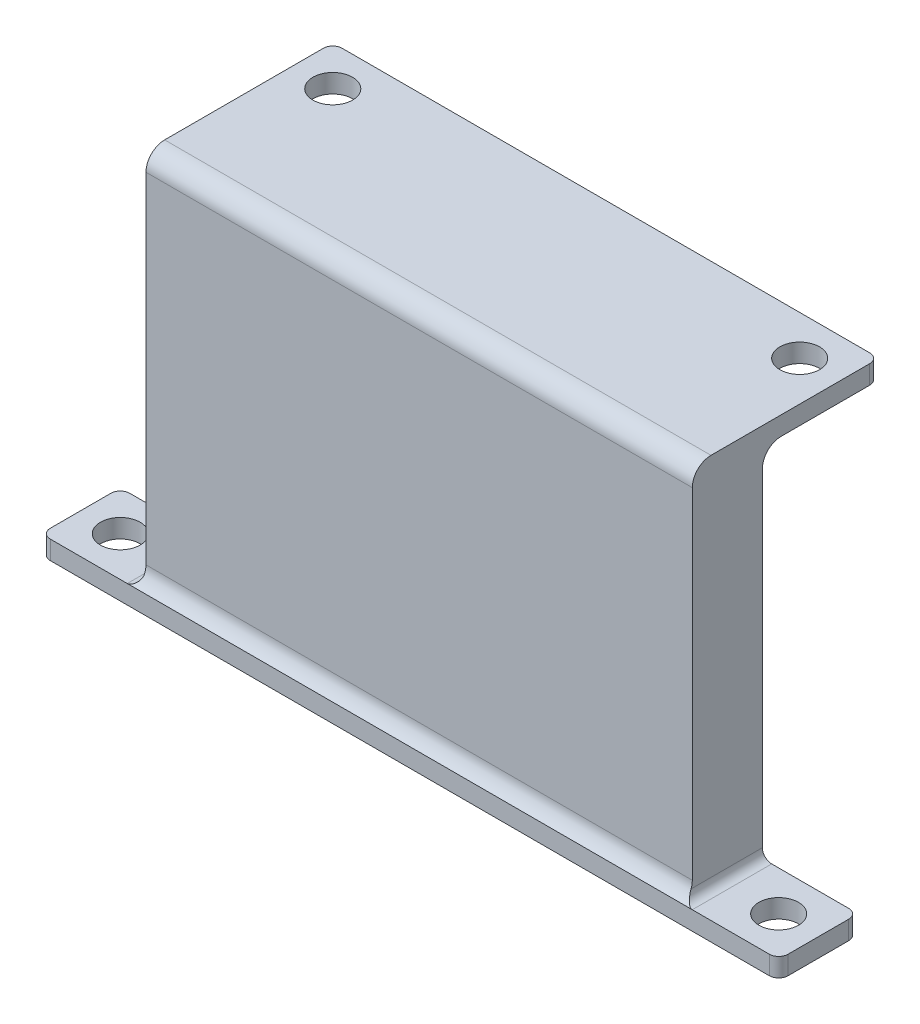
ISO-10303-21;
HEADER;
FILE_DESCRIPTION(('STEP AP214'),'2;1');
FILE_NAME('part.step','',(''),(''),'','','');
FILE_SCHEMA(('AUTOMOTIVE_DESIGN { 1 0 10303 214 1 1 1 1 }'));
ENDSEC;
DATA;
#1=APPLICATION_CONTEXT('core data for automotive mechanical design processes');
#2=APPLICATION_PROTOCOL_DEFINITION('international standard','automotive_design',2000,#1);
#3=PRODUCT_CONTEXT('',#1,'mechanical');
#4=PRODUCT('Part','Part','',(#3));
#5=PRODUCT_RELATED_PRODUCT_CATEGORY('part','',(#4));
#6=PRODUCT_DEFINITION_FORMATION('','',#4);
#7=PRODUCT_DEFINITION_CONTEXT('part definition',#1,'design');
#8=PRODUCT_DEFINITION('design','',#6,#7);
#9=PRODUCT_DEFINITION_SHAPE('','',#8);
#10=(LENGTH_UNIT() NAMED_UNIT(*) SI_UNIT(.MILLI.,.METRE.));
#11=(NAMED_UNIT(*) PLANE_ANGLE_UNIT() SI_UNIT($,.RADIAN.));
#12=(NAMED_UNIT(*) SI_UNIT($,.STERADIAN.) SOLID_ANGLE_UNIT());
#13=UNCERTAINTY_MEASURE_WITH_UNIT(LENGTH_MEASURE(1.E-05),#10,'distance_accuracy_value','');
#14=(GEOMETRIC_REPRESENTATION_CONTEXT(3) GLOBAL_UNCERTAINTY_ASSIGNED_CONTEXT((#13)) GLOBAL_UNIT_ASSIGNED_CONTEXT((#10,
#11,#12)) REPRESENTATION_CONTEXT('',''));
#15=CARTESIAN_POINT('',(0.,0.,0.));
#16=DIRECTION('',(0.,0.,1.));
#17=DIRECTION('',(1.,0.,0.));
#18=AXIS2_PLACEMENT_3D('',#15,#16,#17);
#19=CARTESIAN_POINT('',(0.,2.,0.));
#20=DIRECTION('',(0.,1.,0.));
#21=DIRECTION('',(0.,0.,1.));
#22=AXIS2_PLACEMENT_3D('',#19,#20,#21);
#23=PLANE('',#22);
#24=CARTESIAN_POINT('',(-4.25,2.,-4.24999999999998));
#25=DIRECTION('',(0.,1.,0.));
#26=DIRECTION('',(0.,0.,1.));
#27=AXIS2_PLACEMENT_3D('',#24,#25,#26);
#28=CIRCLE('',#27,2.125);
#29=CARTESIAN_POINT('',(-4.25,2.,-2.12499999999998));
#30=VERTEX_POINT('',#29);
#31=EDGE_CURVE('E348',#30,#30,#28,.T.);
#32=ORIENTED_EDGE('',*,*,#31,.F.);
#33=EDGE_LOOP('',(#32));
#34=FACE_BOUND('',#33,.T.);
#35=DIRECTION('',(-1.,0.,0.));
#36=VECTOR('',#35,1.);
#37=CARTESIAN_POINT('',(0.,2.,-8.5));
#38=LINE('',#37,#36);
#39=CARTESIAN_POINT('',(-1.,2.,-8.5));
#40=VERTEX_POINT('',#39);
#41=CARTESIAN_POINT('',(-9.25000000000001,2.,-8.5));
#42=VERTEX_POINT('',#41);
#43=EDGE_CURVE('E364',#40,#42,#38,.T.);
#44=ORIENTED_EDGE('',*,*,#43,.T.);
#45=DIRECTION('',(0.,0.,-1.));
#46=VECTOR('',#45,1.);
#47=CARTESIAN_POINT('',(-9.25,2.,0.));
#48=LINE('',#47,#46);
#49=CARTESIAN_POINT('',(-9.25,2.,0.));
#50=VERTEX_POINT('',#49);
#51=EDGE_CURVE('E261',#42,#50,#48,.F.);
#52=ORIENTED_EDGE('',*,*,#51,.T.);
#53=DIRECTION('',(1.,0.,0.));
#54=VECTOR('',#53,1.);
#55=CARTESIAN_POINT('',(0.,2.,0.));
#56=LINE('',#55,#54);
#57=CARTESIAN_POINT('',(-1.,2.,0.));
#58=VERTEX_POINT('',#57);
#59=EDGE_CURVE('E210',#50,#58,#56,.T.);
#60=ORIENTED_EDGE('',*,*,#59,.T.);
#61=CARTESIAN_POINT('',(-1.,2.,-1.));
#62=DIRECTION('',(0.,1.,0.));
#63=DIRECTION('',(0.,0.,1.));
#64=AXIS2_PLACEMENT_3D('',#61,#62,#63);
#65=CIRCLE('',#64,1.);
#66=CARTESIAN_POINT('',(0.,2.,-1.));
#67=VERTEX_POINT('',#66);
#68=EDGE_CURVE('E245',#58,#67,#65,.T.);
#69=ORIENTED_EDGE('',*,*,#68,.T.);
#70=DIRECTION('',(0.,0.,-1.));
#71=VECTOR('',#70,1.);
#72=CARTESIAN_POINT('',(0.,2.,0.));
#73=LINE('',#72,#71);
#74=CARTESIAN_POINT('',(0.,2.,-7.5));
#75=VERTEX_POINT('',#74);
#76=EDGE_CURVE('E353',#67,#75,#73,.T.);
#77=ORIENTED_EDGE('',*,*,#76,.T.);
#78=CARTESIAN_POINT('',(-1.,2.,-7.5));
#79=DIRECTION('',(0.,1.,0.));
#80=DIRECTION('',(0.,0.,1.));
#81=AXIS2_PLACEMENT_3D('',#78,#79,#80);
#82=CIRCLE('',#81,1.);
#83=EDGE_CURVE('E247',#75,#40,#82,.T.);
#84=ORIENTED_EDGE('',*,*,#83,.T.);
#85=EDGE_LOOP('',(#44,#52,#60,#69,#77,#84));
#86=FACE_BOUND('',#85,.T.);
#87=ADVANCED_FACE('F35',(#34,#86),#23,.T.);
#88=CARTESIAN_POINT('',(0.,2.,-8.5));
#89=DIRECTION('',(0.,0.,1.));
#90=DIRECTION('',(1.,0.,0.));
#91=AXIS2_PLACEMENT_3D('',#88,#89,#90);
#92=PLANE('',#91);
#93=DIRECTION('',(-1.,0.,0.));
#94=VECTOR('',#93,1.);
#95=CARTESIAN_POINT('',(0.,0.,-8.5));
#96=LINE('',#95,#94);
#97=CARTESIAN_POINT('',(-1.,0.,-8.5));
#98=VERTEX_POINT('',#97);
#99=CARTESIAN_POINT('',(-78.,0.,-8.49999999999998));
#100=VERTEX_POINT('',#99);
#101=EDGE_CURVE('E345',#98,#100,#96,.T.);
#102=ORIENTED_EDGE('',*,*,#101,.T.);
#103=DIRECTION('',(0.,-1.,0.));
#104=VECTOR('',#103,1.);
#105=CARTESIAN_POINT('',(-78.,2.,-8.49999999999998));
#106=LINE('',#105,#104);
#107=CARTESIAN_POINT('',(-78.,2.,-8.49999999999998));
#108=VERTEX_POINT('',#107);
#109=EDGE_CURVE('E373',#100,#108,#106,.F.);
#110=ORIENTED_EDGE('',*,*,#109,.T.);
#111=CARTESIAN_POINT('',(-69.75,2.,-8.49999999999998));
#112=VERTEX_POINT('',#111);
#113=EDGE_CURVE('E356',#112,#108,#38,.T.);
#114=ORIENTED_EDGE('',*,*,#113,.F.);
#115=CARTESIAN_POINT('',(-69.75,3.,-8.49999999999998));
#116=DIRECTION('',(0.,0.,1.));
#117=DIRECTION('',(1.,0.,0.));
#118=AXIS2_PLACEMENT_3D('',#115,#116,#117);
#119=CIRCLE('',#118,1.);
#120=CARTESIAN_POINT('',(-68.75,3.,-8.49999999999999));
#121=VERTEX_POINT('',#120);
#122=EDGE_CURVE('E11',#112,#121,#119,.T.);
#123=ORIENTED_EDGE('',*,*,#122,.T.);
#124=DIRECTION('',(0.,-1.,0.));
#125=VECTOR('',#124,1.);
#126=CARTESIAN_POINT('',(-68.75,42.14,-8.49999999999999));
#127=LINE('',#126,#125);
#128=CARTESIAN_POINT('',(-68.75,38.14,-8.49999999999999));
#129=VERTEX_POINT('',#128);
#130=EDGE_CURVE('E220',#129,#121,#127,.T.);
#131=ORIENTED_EDGE('',*,*,#130,.F.);
#132=DIRECTION('',(-1.,0.,0.));
#133=VECTOR('',#132,1.);
#134=CARTESIAN_POINT('',(-10.25,38.14,-8.5));
#135=LINE('',#134,#133);
#136=CARTESIAN_POINT('',(-10.25,38.14,-8.49999999999999));
#137=VERTEX_POINT('',#136);
#138=EDGE_CURVE('E199',#129,#137,#135,.F.);
#139=ORIENTED_EDGE('',*,*,#138,.T.);
#140=DIRECTION('',(0.,-1.,0.));
#141=VECTOR('',#140,1.);
#142=CARTESIAN_POINT('',(-10.25,42.14,-8.49999999999999));
#143=LINE('',#142,#141);
#144=CARTESIAN_POINT('',(-10.25,3.,-8.49999999999999));
#145=VERTEX_POINT('',#144);
#146=EDGE_CURVE('E215',#137,#145,#143,.T.);
#147=ORIENTED_EDGE('',*,*,#146,.T.);
#148=CARTESIAN_POINT('',(-9.25000000000001,3.,-8.5));
#149=DIRECTION('',(0.,0.,1.));
#150=DIRECTION('',(1.,0.,0.));
#151=AXIS2_PLACEMENT_3D('',#148,#149,#150);
#152=CIRCLE('',#151,1.);
#153=EDGE_CURVE('E264',#145,#42,#152,.T.);
#154=ORIENTED_EDGE('',*,*,#153,.T.);
#155=ORIENTED_EDGE('',*,*,#43,.F.);
#156=DIRECTION('',(0.,-1.,0.));
#157=VECTOR('',#156,1.);
#158=CARTESIAN_POINT('',(-1.,2.,-8.5));
#159=LINE('',#158,#157);
#160=EDGE_CURVE('E370',#40,#98,#159,.T.);
#161=ORIENTED_EDGE('',*,*,#160,.T.);
#162=EDGE_LOOP('',(#102,#110,#114,#123,#131,#139,#147,#154,#155,#161));
#163=FACE_BOUND('',#162,.T.);
#164=ADVANCED_FACE('F315',(#163),#92,.F.);
#165=CARTESIAN_POINT('',(-78.,2.,0.));
#166=VERTEX_POINT('',#165);
#167=CARTESIAN_POINT('',(-69.75,2.,0.));
#168=VERTEX_POINT('',#167);
#169=EDGE_CURVE('E206',#166,#168,#56,.T.);
#170=ORIENTED_EDGE('',*,*,#169,.T.);
#171=DIRECTION('',(0.,0.,1.));
#172=VECTOR('',#171,1.);
#173=CARTESIAN_POINT('',(-69.75,2.,0.));
#174=LINE('',#173,#172);
#175=EDGE_CURVE('E58',#168,#112,#174,.F.);
#176=ORIENTED_EDGE('',*,*,#175,.T.);
#177=ORIENTED_EDGE('',*,*,#113,.T.);
#178=CARTESIAN_POINT('',(-78.,2.,-7.49999999999998));
#179=DIRECTION('',(0.,1.,0.));
#180=DIRECTION('',(0.,0.,1.));
#181=AXIS2_PLACEMENT_3D('',#178,#179,#180);
#182=CIRCLE('',#181,1.);
#183=CARTESIAN_POINT('',(-79.,2.,-7.49999999999998));
#184=VERTEX_POINT('',#183);
#185=EDGE_CURVE('E509',#108,#184,#182,.T.);
#186=ORIENTED_EDGE('',*,*,#185,.T.);
#187=DIRECTION('',(0.,0.,1.));
#188=VECTOR('',#187,1.);
#189=CARTESIAN_POINT('',(-79.,2.,0.));
#190=LINE('',#189,#188);
#191=CARTESIAN_POINT('',(-79.,2.,-0.999999999999985));
#192=VERTEX_POINT('',#191);
#193=EDGE_CURVE('E360',#184,#192,#190,.T.);
#194=ORIENTED_EDGE('',*,*,#193,.T.);
#195=CARTESIAN_POINT('',(-78.,2.,-0.999999999999985));
#196=DIRECTION('',(0.,1.,0.));
#197=DIRECTION('',(0.,0.,1.));
#198=AXIS2_PLACEMENT_3D('',#195,#196,#197);
#199=CIRCLE('',#198,1.);
#200=EDGE_CURVE('E368',#192,#166,#199,.T.);
#201=ORIENTED_EDGE('',*,*,#200,.T.);
#202=EDGE_LOOP('',(#170,#176,#177,#186,#194,#201));
#203=FACE_BOUND('',#202,.T.);
#204=CARTESIAN_POINT('',(-74.75,2.,-4.24999999999998));
#205=DIRECTION('',(0.,1.,0.));
#206=DIRECTION('',(0.,0.,1.));
#207=AXIS2_PLACEMENT_3D('',#204,#205,#206);
#208=CIRCLE('',#207,2.125);
#209=CARTESIAN_POINT('',(-74.75,2.,-2.12499999999998));
#210=VERTEX_POINT('',#209);
#211=EDGE_CURVE('E339',#210,#210,#208,.T.);
#212=ORIENTED_EDGE('',*,*,#211,.F.);
#213=EDGE_LOOP('',(#212));
#214=FACE_BOUND('',#213,.T.);
#215=ADVANCED_FACE('F318',(#203,#214),#23,.T.);
#216=CARTESIAN_POINT('',(0.,0.,0.));
#217=DIRECTION('',(0.,1.,0.));
#218=DIRECTION('',(0.,0.,1.));
#219=AXIS2_PLACEMENT_3D('',#216,#217,#218);
#220=PLANE('',#219);
#221=DIRECTION('',(1.,0.,0.));
#222=VECTOR('',#221,1.);
#223=CARTESIAN_POINT('',(0.,0.,0.));
#224=LINE('',#223,#222);
#225=CARTESIAN_POINT('',(-78.,0.,0.));
#226=VERTEX_POINT('',#225);
#227=CARTESIAN_POINT('',(-1.,0.,0.));
#228=VERTEX_POINT('',#227);
#229=EDGE_CURVE('E357',#226,#228,#224,.T.);
#230=ORIENTED_EDGE('',*,*,#229,.F.);
#231=CARTESIAN_POINT('',(-78.,0.,-0.999999999999985));
#232=DIRECTION('',(0.,1.,0.));
#233=DIRECTION('',(0.,0.,1.));
#234=AXIS2_PLACEMENT_3D('',#231,#232,#233);
#235=CIRCLE('',#234,1.);
#236=CARTESIAN_POINT('',(-79.,0.,-0.999999999999985));
#237=VERTEX_POINT('',#236);
#238=EDGE_CURVE('E490',#226,#237,#235,.F.);
#239=ORIENTED_EDGE('',*,*,#238,.T.);
#240=DIRECTION('',(0.,0.,1.));
#241=VECTOR('',#240,1.);
#242=CARTESIAN_POINT('',(-79.,0.,0.));
#243=LINE('',#242,#241);
#244=CARTESIAN_POINT('',(-79.,0.,-7.49999999999998));
#245=VERTEX_POINT('',#244);
#246=EDGE_CURVE('E517',#245,#237,#243,.T.);
#247=ORIENTED_EDGE('',*,*,#246,.F.);
#248=CARTESIAN_POINT('',(-78.,0.,-7.49999999999998));
#249=DIRECTION('',(0.,1.,0.));
#250=DIRECTION('',(0.,0.,1.));
#251=AXIS2_PLACEMENT_3D('',#248,#249,#250);
#252=CIRCLE('',#251,1.);
#253=EDGE_CURVE('E502',#245,#100,#252,.F.);
#254=ORIENTED_EDGE('',*,*,#253,.T.);
#255=ORIENTED_EDGE('',*,*,#101,.F.);
#256=CARTESIAN_POINT('',(-1.,0.,-7.5));
#257=DIRECTION('',(0.,1.,0.));
#258=DIRECTION('',(0.,0.,1.));
#259=AXIS2_PLACEMENT_3D('',#256,#257,#258);
#260=CIRCLE('',#259,1.);
#261=CARTESIAN_POINT('',(0.,0.,-7.5));
#262=VERTEX_POINT('',#261);
#263=EDGE_CURVE('E494',#98,#262,#260,.F.);
#264=ORIENTED_EDGE('',*,*,#263,.T.);
#265=DIRECTION('',(0.,0.,-1.));
#266=VECTOR('',#265,1.);
#267=CARTESIAN_POINT('',(0.,0.,0.));
#268=LINE('',#267,#266);
#269=CARTESIAN_POINT('',(0.,0.,-1.));
#270=VERTEX_POINT('',#269);
#271=EDGE_CURVE('E341',#270,#262,#268,.T.);
#272=ORIENTED_EDGE('',*,*,#271,.F.);
#273=CARTESIAN_POINT('',(-1.,0.,-1.));
#274=DIRECTION('',(0.,1.,0.));
#275=DIRECTION('',(0.,0.,1.));
#276=AXIS2_PLACEMENT_3D('',#273,#274,#275);
#277=CIRCLE('',#276,1.);
#278=EDGE_CURVE('E491',#270,#228,#277,.F.);
#279=ORIENTED_EDGE('',*,*,#278,.T.);
#280=EDGE_LOOP('',(#230,#239,#247,#254,#255,#264,#272,#279));
#281=FACE_BOUND('',#280,.T.);
#282=CARTESIAN_POINT('',(-74.75,0.,-4.24999999999998));
#283=DIRECTION('',(0.,1.,0.));
#284=DIRECTION('',(0.,0.,1.));
#285=AXIS2_PLACEMENT_3D('',#282,#283,#284);
#286=CIRCLE('',#285,2.125);
#287=CARTESIAN_POINT('',(-74.75,0.,-2.12499999999998));
#288=VERTEX_POINT('',#287);
#289=EDGE_CURVE('E342',#288,#288,#286,.T.);
#290=ORIENTED_EDGE('',*,*,#289,.T.);
#291=EDGE_LOOP('',(#290));
#292=FACE_BOUND('',#291,.T.);
#293=CARTESIAN_POINT('',(-4.25,0.,-4.24999999999998));
#294=DIRECTION('',(0.,1.,0.));
#295=DIRECTION('',(0.,0.,1.));
#296=AXIS2_PLACEMENT_3D('',#293,#294,#295);
#297=CIRCLE('',#296,2.125);
#298=CARTESIAN_POINT('',(-4.25,0.,-2.12499999999998));
#299=VERTEX_POINT('',#298);
#300=EDGE_CURVE('E219',#299,#299,#297,.T.);
#301=ORIENTED_EDGE('',*,*,#300,.T.);
#302=EDGE_LOOP('',(#301));
#303=FACE_BOUND('',#302,.T.);
#304=ADVANCED_FACE('F329',(#281,#292,#303),#220,.F.);
#305=CARTESIAN_POINT('',(0.,2.,0.));
#306=DIRECTION('',(-1.,0.,0.));
#307=DIRECTION('',(0.,0.,1.));
#308=AXIS2_PLACEMENT_3D('',#305,#306,#307);
#309=PLANE('',#308);
#310=ORIENTED_EDGE('',*,*,#271,.T.);
#311=DIRECTION('',(0.,-1.,0.));
#312=VECTOR('',#311,1.);
#313=CARTESIAN_POINT('',(0.,2.,-7.5));
#314=LINE('',#313,#312);
#315=EDGE_CURVE('E243',#262,#75,#314,.F.);
#316=ORIENTED_EDGE('',*,*,#315,.T.);
#317=ORIENTED_EDGE('',*,*,#76,.F.);
#318=DIRECTION('',(0.,-1.,0.));
#319=VECTOR('',#318,1.);
#320=CARTESIAN_POINT('',(0.,2.,-1.));
#321=LINE('',#320,#319);
#322=EDGE_CURVE('E240',#67,#270,#321,.T.);
#323=ORIENTED_EDGE('',*,*,#322,.T.);
#324=EDGE_LOOP('',(#310,#316,#317,#323));
#325=FACE_BOUND('',#324,.T.);
#326=ADVANCED_FACE('F333',(#325),#309,.F.);
#327=CARTESIAN_POINT('',(-79.,2.,0.));
#328=DIRECTION('',(1.,0.,0.));
#329=DIRECTION('',(0.,0.,-1.));
#330=AXIS2_PLACEMENT_3D('',#327,#328,#329);
#331=PLANE('',#330);
#332=ORIENTED_EDGE('',*,*,#246,.T.);
#333=DIRECTION('',(0.,-1.,0.));
#334=VECTOR('',#333,1.);
#335=CARTESIAN_POINT('',(-79.,2.,-0.999999999999985));
#336=LINE('',#335,#334);
#337=EDGE_CURVE('E508',#237,#192,#336,.F.);
#338=ORIENTED_EDGE('',*,*,#337,.T.);
#339=ORIENTED_EDGE('',*,*,#193,.F.);
#340=DIRECTION('',(0.,-1.,0.));
#341=VECTOR('',#340,1.);
#342=CARTESIAN_POINT('',(-79.,2.,-7.49999999999998));
#343=LINE('',#342,#341);
#344=EDGE_CURVE('E505',#184,#245,#343,.T.);
#345=ORIENTED_EDGE('',*,*,#344,.T.);
#346=EDGE_LOOP('',(#332,#338,#339,#345));
#347=FACE_BOUND('',#346,.T.);
#348=ADVANCED_FACE('F475',(#347),#331,.F.);
#349=CARTESIAN_POINT('',(0.,2.,0.));
#350=DIRECTION('',(0.,0.,-1.));
#351=DIRECTION('',(-1.,0.,0.));
#352=AXIS2_PLACEMENT_3D('',#349,#350,#351);
#353=PLANE('',#352);
#354=ORIENTED_EDGE('',*,*,#169,.F.);
#355=DIRECTION('',(0.,-1.,0.));
#356=VECTOR('',#355,1.);
#357=CARTESIAN_POINT('',(-78.,2.,0.));
#358=LINE('',#357,#356);
#359=EDGE_CURVE('E487',#166,#226,#358,.T.);
#360=ORIENTED_EDGE('',*,*,#359,.T.);
#361=ORIENTED_EDGE('',*,*,#229,.T.);
#362=DIRECTION('',(0.,-1.,0.));
#363=VECTOR('',#362,1.);
#364=CARTESIAN_POINT('',(-1.,2.,0.));
#365=LINE('',#364,#363);
#366=EDGE_CURVE('E492',#228,#58,#365,.F.);
#367=ORIENTED_EDGE('',*,*,#366,.T.);
#368=ORIENTED_EDGE('',*,*,#59,.F.);
#369=EDGE_CURVE('E51',#168,#50,#56,.T.);
#370=ORIENTED_EDGE('',*,*,#369,.F.);
#371=EDGE_LOOP('',(#354,#360,#361,#367,#368,#370));
#372=FACE_BOUND('',#371,.T.);
#373=ADVANCED_FACE('F430',(#372),#353,.F.);
#374=CARTESIAN_POINT('',(-74.75,2.,-4.24999999999998));
#375=DIRECTION('',(0.,-1.,0.));
#376=DIRECTION('',(0.,0.,-1.));
#377=AXIS2_PLACEMENT_3D('',#374,#375,#376);
#378=CYLINDRICAL_SURFACE('',#377,2.125);
#379=ORIENTED_EDGE('',*,*,#211,.T.);
#380=EDGE_LOOP('',(#379));
#381=FACE_BOUND('',#380,.T.);
#382=ORIENTED_EDGE('',*,*,#289,.F.);
#383=EDGE_LOOP('',(#382));
#384=FACE_BOUND('',#383,.T.);
#385=ADVANCED_FACE('F422',(#381,#384),#378,.F.);
#386=CARTESIAN_POINT('',(-4.25,2.,-4.24999999999998));
#387=DIRECTION('',(0.,-1.,0.));
#388=DIRECTION('',(0.,0.,-1.));
#389=AXIS2_PLACEMENT_3D('',#386,#387,#388);
#390=CYLINDRICAL_SURFACE('',#389,2.125);
#391=ORIENTED_EDGE('',*,*,#31,.T.);
#392=EDGE_LOOP('',(#391));
#393=FACE_BOUND('',#392,.T.);
#394=ORIENTED_EDGE('',*,*,#300,.F.);
#395=EDGE_LOOP('',(#394));
#396=FACE_BOUND('',#395,.T.);
#397=ADVANCED_FACE('F419',(#393,#396),#390,.F.);
#398=CARTESIAN_POINT('',(-10.25,42.14,-0.999999999999996));
#399=DIRECTION('',(-1.,0.,0.));
#400=DIRECTION('',(0.,0.,1.));
#401=AXIS2_PLACEMENT_3D('',#398,#399,#400);
#402=PLANE('',#401);
#403=CARTESIAN_POINT('',(-10.25,3.73205080756887,1.00000000000001));
#404=DIRECTION('',(-1.,0.,0.));
#405=DIRECTION('',(0.,0.,1.));
#406=AXIS2_PLACEMENT_3D('',#403,#404,#405);
#407=CIRCLE('',#406,2.);
#408=CARTESIAN_POINT('',(-10.25,3.73205080756887,-0.999999999999996));
#409=VERTEX_POINT('',#408);
#410=CARTESIAN_POINT('',(-10.25,3.,-0.861209718204195));
#411=VERTEX_POINT('',#410);
#412=EDGE_CURVE('E535',#409,#411,#407,.T.);
#413=ORIENTED_EDGE('',*,*,#412,.T.);
#414=DIRECTION('',(0.,0.,-1.));
#415=VECTOR('',#414,1.);
#416=CARTESIAN_POINT('',(-10.25,3.,-0.999999999999996));
#417=LINE('',#416,#415);
#418=EDGE_CURVE('E258',#411,#145,#417,.T.);
#419=ORIENTED_EDGE('',*,*,#418,.T.);
#420=ORIENTED_EDGE('',*,*,#146,.F.);
#421=CARTESIAN_POINT('',(-10.25,38.14,-10.5));
#422=DIRECTION('',(-1.,0.,0.));
#423=DIRECTION('',(0.,0.,1.));
#424=AXIS2_PLACEMENT_3D('',#421,#422,#423);
#425=CIRCLE('',#424,2.);
#426=CARTESIAN_POINT('',(-10.25,40.14,-10.5));
#427=VERTEX_POINT('',#426);
#428=EDGE_CURVE('E200',#137,#427,#425,.T.);
#429=ORIENTED_EDGE('',*,*,#428,.T.);
#430=DIRECTION('',(0.,0.,1.));
#431=VECTOR('',#430,1.);
#432=CARTESIAN_POINT('',(-10.25,40.14,-21.));
#433=LINE('',#432,#431);
#434=CARTESIAN_POINT('',(-10.25,40.14,-20.));
#435=VERTEX_POINT('',#434);
#436=EDGE_CURVE('E190',#435,#427,#433,.T.);
#437=ORIENTED_EDGE('',*,*,#436,.F.);
#438=DIRECTION('',(0.,-1.,0.));
#439=VECTOR('',#438,1.);
#440=CARTESIAN_POINT('',(-10.25,42.14,-20.));
#441=LINE('',#440,#439);
#442=CARTESIAN_POINT('',(-10.25,42.14,-20.));
#443=VERTEX_POINT('',#442);
#444=EDGE_CURVE('E237',#435,#443,#441,.F.);
#445=ORIENTED_EDGE('',*,*,#444,.T.);
#446=DIRECTION('',(0.,0.,-1.));
#447=VECTOR('',#446,1.);
#448=CARTESIAN_POINT('',(-10.25,42.14,-0.999999999999996));
#449=LINE('',#448,#447);
#450=CARTESIAN_POINT('',(-10.25,42.14,-3.));
#451=VERTEX_POINT('',#450);
#452=EDGE_CURVE('E233',#451,#443,#449,.T.);
#453=ORIENTED_EDGE('',*,*,#452,.F.);
#454=CARTESIAN_POINT('',(-10.25,40.14,-3.));
#455=DIRECTION('',(-1.,0.,0.));
#456=DIRECTION('',(0.,0.,1.));
#457=AXIS2_PLACEMENT_3D('',#454,#455,#456);
#458=CIRCLE('',#457,2.);
#459=CARTESIAN_POINT('',(-10.25,40.14,-0.999999999999996));
#460=VERTEX_POINT('',#459);
#461=EDGE_CURVE('E252',#451,#460,#458,.F.);
#462=ORIENTED_EDGE('',*,*,#461,.T.);
#463=DIRECTION('',(0.,-1.,0.));
#464=VECTOR('',#463,1.);
#465=CARTESIAN_POINT('',(-10.25,42.14,-0.999999999999996));
#466=LINE('',#465,#464);
#467=EDGE_CURVE('E393',#460,#409,#466,.T.);
#468=ORIENTED_EDGE('',*,*,#467,.T.);
#469=EDGE_LOOP('',(#413,#419,#420,#429,#437,#445,#453,#462,#468));
#470=FACE_BOUND('',#469,.T.);
#471=ADVANCED_FACE('F421',(#470),#402,.F.);
#472=CARTESIAN_POINT('',(-68.75,42.14,-0.999999999999996));
#473=DIRECTION('',(1.,0.,0.));
#474=DIRECTION('',(0.,0.,-1.));
#475=AXIS2_PLACEMENT_3D('',#472,#473,#474);
#476=PLANE('',#475);
#477=ORIENTED_EDGE('',*,*,#130,.T.);
#478=DIRECTION('',(0.,0.,1.));
#479=VECTOR('',#478,1.);
#480=CARTESIAN_POINT('',(-68.75,3.,-0.999999999999996));
#481=LINE('',#480,#479);
#482=CARTESIAN_POINT('',(-68.75,3.,-0.861209718204183));
#483=VERTEX_POINT('',#482);
#484=EDGE_CURVE('E272',#121,#483,#481,.T.);
#485=ORIENTED_EDGE('',*,*,#484,.T.);
#486=CARTESIAN_POINT('',(-68.75,3.73205080756887,1.00000000000002));
#487=DIRECTION('',(1.,0.,0.));
#488=DIRECTION('',(0.,0.,-1.));
#489=AXIS2_PLACEMENT_3D('',#486,#487,#488);
#490=CIRCLE('',#489,2.);
#491=CARTESIAN_POINT('',(-68.75,3.73205080756887,-0.999999999999996));
#492=VERTEX_POINT('',#491);
#493=EDGE_CURVE('E497',#483,#492,#490,.T.);
#494=ORIENTED_EDGE('',*,*,#493,.T.);
#495=DIRECTION('',(0.,-1.,0.));
#496=VECTOR('',#495,1.);
#497=CARTESIAN_POINT('',(-68.75,42.14,-0.999999999999996));
#498=LINE('',#497,#496);
#499=CARTESIAN_POINT('',(-68.75,40.14,-0.999999999999996));
#500=VERTEX_POINT('',#499);
#501=EDGE_CURVE('E411',#500,#492,#498,.T.);
#502=ORIENTED_EDGE('',*,*,#501,.F.);
#503=CARTESIAN_POINT('',(-68.75,40.14,-3.));
#504=DIRECTION('',(1.,0.,0.));
#505=DIRECTION('',(0.,0.,-1.));
#506=AXIS2_PLACEMENT_3D('',#503,#504,#505);
#507=CIRCLE('',#506,2.);
#508=CARTESIAN_POINT('',(-68.75,42.14,-3.));
#509=VERTEX_POINT('',#508);
#510=EDGE_CURVE('E256',#500,#509,#507,.F.);
#511=ORIENTED_EDGE('',*,*,#510,.T.);
#512=DIRECTION('',(0.,0.,1.));
#513=VECTOR('',#512,1.);
#514=CARTESIAN_POINT('',(-68.75,42.14,-0.999999999999996));
#515=LINE('',#514,#513);
#516=CARTESIAN_POINT('',(-68.75,42.14,-20.));
#517=VERTEX_POINT('',#516);
#518=EDGE_CURVE('E388',#517,#509,#515,.T.);
#519=ORIENTED_EDGE('',*,*,#518,.F.);
#520=DIRECTION('',(0.,1.,0.));
#521=VECTOR('',#520,1.);
#522=CARTESIAN_POINT('',(-68.75,40.14,-20.));
#523=LINE('',#522,#521);
#524=CARTESIAN_POINT('',(-68.75,40.14,-20.));
#525=VERTEX_POINT('',#524);
#526=EDGE_CURVE('E186',#517,#525,#523,.F.);
#527=ORIENTED_EDGE('',*,*,#526,.T.);
#528=DIRECTION('',(0.,0.,1.));
#529=VECTOR('',#528,1.);
#530=CARTESIAN_POINT('',(-68.75,40.14,-21.));
#531=LINE('',#530,#529);
#532=CARTESIAN_POINT('',(-68.75,40.14,-10.5));
#533=VERTEX_POINT('',#532);
#534=EDGE_CURVE('E178',#525,#533,#531,.T.);
#535=ORIENTED_EDGE('',*,*,#534,.T.);
#536=CARTESIAN_POINT('',(-68.75,38.14,-10.5));
#537=DIRECTION('',(1.,0.,0.));
#538=DIRECTION('',(0.,0.,-1.));
#539=AXIS2_PLACEMENT_3D('',#536,#537,#538);
#540=CIRCLE('',#539,2.);
#541=EDGE_CURVE('E182',#533,#129,#540,.T.);
#542=ORIENTED_EDGE('',*,*,#541,.T.);
#543=EDGE_LOOP('',(#477,#485,#494,#502,#511,#519,#527,#535,#542));
#544=FACE_BOUND('',#543,.T.);
#545=ADVANCED_FACE('F181',(#544),#476,.F.);
#546=CARTESIAN_POINT('',(-68.75,42.14,-0.999999999999996));
#547=DIRECTION('',(0.,0.,-1.));
#548=DIRECTION('',(-1.,0.,0.));
#549=AXIS2_PLACEMENT_3D('',#546,#547,#548);
#550=PLANE('',#549);
#551=ORIENTED_EDGE('',*,*,#467,.F.);
#552=DIRECTION('',(1.,0.,0.));
#553=VECTOR('',#552,1.);
#554=CARTESIAN_POINT('',(-68.75,40.14,-0.999999999999996));
#555=LINE('',#554,#553);
#556=EDGE_CURVE('E254',#460,#500,#555,.F.);
#557=ORIENTED_EDGE('',*,*,#556,.T.);
#558=ORIENTED_EDGE('',*,*,#501,.T.);
#559=DIRECTION('',(-1.,0.,0.));
#560=VECTOR('',#559,1.);
#561=CARTESIAN_POINT('',(-68.75,3.73205080756887,-0.999999999999996));
#562=LINE('',#561,#560);
#563=EDGE_CURVE('E201',#492,#409,#562,.F.);
#564=ORIENTED_EDGE('',*,*,#563,.T.);
#565=EDGE_LOOP('',(#551,#557,#558,#564));
#566=FACE_BOUND('',#565,.T.);
#567=ADVANCED_FACE('F434',(#566),#550,.F.);
#568=CARTESIAN_POINT('',(0.,42.14,0.));
#569=DIRECTION('',(0.,-1.,0.));
#570=DIRECTION('',(0.,0.,-1.));
#571=AXIS2_PLACEMENT_3D('',#568,#569,#570);
#572=PLANE('',#571);
#573=CARTESIAN_POINT('',(-64.5,42.14,-16.75));
#574=DIRECTION('',(0.,1.,0.));
#575=DIRECTION('',(0.,0.,1.));
#576=AXIS2_PLACEMENT_3D('',#573,#574,#575);
#577=CIRCLE('',#576,2.125);
#578=CARTESIAN_POINT('',(-64.5,42.14,-14.625));
#579=VERTEX_POINT('',#578);
#580=EDGE_CURVE('E459',#579,#579,#577,.T.);
#581=ORIENTED_EDGE('',*,*,#580,.F.);
#582=EDGE_LOOP('',(#581));
#583=FACE_BOUND('',#582,.T.);
#584=CARTESIAN_POINT('',(-14.5,42.14,-16.75));
#585=DIRECTION('',(0.,1.,0.));
#586=DIRECTION('',(0.,0.,1.));
#587=AXIS2_PLACEMENT_3D('',#584,#585,#586);
#588=CIRCLE('',#587,2.125);
#589=CARTESIAN_POINT('',(-14.5,42.14,-14.625));
#590=VERTEX_POINT('',#589);
#591=EDGE_CURVE('E405',#590,#590,#588,.T.);
#592=ORIENTED_EDGE('',*,*,#591,.F.);
#593=EDGE_LOOP('',(#592));
#594=FACE_BOUND('',#593,.T.);
#595=ORIENTED_EDGE('',*,*,#518,.T.);
#596=DIRECTION('',(1.,0.,0.));
#597=VECTOR('',#596,1.);
#598=CARTESIAN_POINT('',(0.,42.14,-3.));
#599=LINE('',#598,#597);
#600=EDGE_CURVE('E249',#509,#451,#599,.T.);
#601=ORIENTED_EDGE('',*,*,#600,.T.);
#602=ORIENTED_EDGE('',*,*,#452,.T.);
#603=CARTESIAN_POINT('',(-11.25,42.14,-20.));
#604=DIRECTION('',(0.,-1.,0.));
#605=DIRECTION('',(0.,0.,-1.));
#606=AXIS2_PLACEMENT_3D('',#603,#604,#605);
#607=CIRCLE('',#606,1.);
#608=CARTESIAN_POINT('',(-11.25,42.14,-21.));
#609=VERTEX_POINT('',#608);
#610=EDGE_CURVE('E381',#443,#609,#607,.F.);
#611=ORIENTED_EDGE('',*,*,#610,.T.);
#612=DIRECTION('',(1.,0.,0.));
#613=VECTOR('',#612,1.);
#614=CARTESIAN_POINT('',(-10.25,42.14,-21.));
#615=LINE('',#614,#613);
#616=CARTESIAN_POINT('',(-67.75,42.14,-21.));
#617=VERTEX_POINT('',#616);
#618=EDGE_CURVE('E191',#617,#609,#615,.T.);
#619=ORIENTED_EDGE('',*,*,#618,.F.);
#620=CARTESIAN_POINT('',(-67.75,42.14,-20.));
#621=DIRECTION('',(0.,-1.,0.));
#622=DIRECTION('',(0.,0.,-1.));
#623=AXIS2_PLACEMENT_3D('',#620,#621,#622);
#624=CIRCLE('',#623,1.);
#625=EDGE_CURVE('E228',#617,#517,#624,.F.);
#626=ORIENTED_EDGE('',*,*,#625,.T.);
#627=EDGE_LOOP('',(#595,#601,#602,#611,#619,#626));
#628=FACE_BOUND('',#627,.T.);
#629=ADVANCED_FACE('F387',(#583,#594,#628),#572,.F.);
#630=CARTESIAN_POINT('',(-10.25,40.14,-21.));
#631=DIRECTION('',(0.,1.,0.));
#632=DIRECTION('',(0.,0.,1.));
#633=AXIS2_PLACEMENT_3D('',#630,#631,#632);
#634=PLANE('',#633);
#635=CARTESIAN_POINT('',(-64.5,40.14,-16.75));
#636=DIRECTION('',(0.,1.,0.));
#637=DIRECTION('',(0.,0.,1.));
#638=AXIS2_PLACEMENT_3D('',#635,#636,#637);
#639=CIRCLE('',#638,2.125);
#640=CARTESIAN_POINT('',(-64.5,40.14,-14.625));
#641=VERTEX_POINT('',#640);
#642=EDGE_CURVE('E462',#641,#641,#639,.F.);
#643=ORIENTED_EDGE('',*,*,#642,.F.);
#644=EDGE_LOOP('',(#643));
#645=FACE_BOUND('',#644,.T.);
#646=CARTESIAN_POINT('',(-14.5,40.14,-16.75));
#647=DIRECTION('',(0.,1.,0.));
#648=DIRECTION('',(0.,0.,1.));
#649=AXIS2_PLACEMENT_3D('',#646,#647,#648);
#650=CIRCLE('',#649,2.125);
#651=CARTESIAN_POINT('',(-14.5,40.14,-14.625));
#652=VERTEX_POINT('',#651);
#653=EDGE_CURVE('E401',#652,#652,#650,.F.);
#654=ORIENTED_EDGE('',*,*,#653,.F.);
#655=EDGE_LOOP('',(#654));
#656=FACE_BOUND('',#655,.T.);
#657=ORIENTED_EDGE('',*,*,#534,.F.);
#658=CARTESIAN_POINT('',(-67.75,40.14,-20.));
#659=DIRECTION('',(0.,1.,0.));
#660=DIRECTION('',(0.,0.,1.));
#661=AXIS2_PLACEMENT_3D('',#658,#659,#660);
#662=CIRCLE('',#661,1.);
#663=CARTESIAN_POINT('',(-67.75,40.14,-21.));
#664=VERTEX_POINT('',#663);
#665=EDGE_CURVE('E235',#525,#664,#662,.F.);
#666=ORIENTED_EDGE('',*,*,#665,.T.);
#667=DIRECTION('',(-1.,0.,0.));
#668=VECTOR('',#667,1.);
#669=CARTESIAN_POINT('',(-10.25,40.14,-21.));
#670=LINE('',#669,#668);
#671=CARTESIAN_POINT('',(-11.25,40.14,-21.));
#672=VERTEX_POINT('',#671);
#673=EDGE_CURVE('E397',#672,#664,#670,.T.);
#674=ORIENTED_EDGE('',*,*,#673,.F.);
#675=CARTESIAN_POINT('',(-11.25,40.14,-20.));
#676=DIRECTION('',(0.,1.,0.));
#677=DIRECTION('',(0.,0.,1.));
#678=AXIS2_PLACEMENT_3D('',#675,#676,#677);
#679=CIRCLE('',#678,1.);
#680=EDGE_CURVE('E231',#672,#435,#679,.F.);
#681=ORIENTED_EDGE('',*,*,#680,.T.);
#682=ORIENTED_EDGE('',*,*,#436,.T.);
#683=DIRECTION('',(-1.,0.,0.));
#684=VECTOR('',#683,1.);
#685=CARTESIAN_POINT('',(-68.75,40.14,-10.5));
#686=LINE('',#685,#684);
#687=EDGE_CURVE('E198',#427,#533,#686,.T.);
#688=ORIENTED_EDGE('',*,*,#687,.T.);
#689=EDGE_LOOP('',(#657,#666,#674,#681,#682,#688));
#690=FACE_BOUND('',#689,.T.);
#691=ADVANCED_FACE('F203',(#645,#656,#690),#634,.F.);
#692=CARTESIAN_POINT('',(0.,0.,-21.));
#693=DIRECTION('',(0.,0.,-1.));
#694=DIRECTION('',(-1.,0.,0.));
#695=AXIS2_PLACEMENT_3D('',#692,#693,#694);
#696=PLANE('',#695);
#697=ORIENTED_EDGE('',*,*,#673,.T.);
#698=DIRECTION('',(0.,1.,0.));
#699=VECTOR('',#698,1.);
#700=CARTESIAN_POINT('',(-67.75,42.14,-21.));
#701=LINE('',#700,#699);
#702=EDGE_CURVE('E379',#664,#617,#701,.T.);
#703=ORIENTED_EDGE('',*,*,#702,.T.);
#704=ORIENTED_EDGE('',*,*,#618,.T.);
#705=DIRECTION('',(0.,-1.,0.));
#706=VECTOR('',#705,1.);
#707=CARTESIAN_POINT('',(-11.25,40.14,-21.));
#708=LINE('',#707,#706);
#709=EDGE_CURVE('E376',#609,#672,#708,.T.);
#710=ORIENTED_EDGE('',*,*,#709,.T.);
#711=EDGE_LOOP('',(#697,#703,#704,#710));
#712=FACE_BOUND('',#711,.T.);
#713=ADVANCED_FACE('F399',(#712),#696,.T.);
#714=CARTESIAN_POINT('',(-14.5,-0.001000000000001,-16.75));
#715=DIRECTION('',(0.,1.,0.));
#716=DIRECTION('',(0.,0.,1.));
#717=AXIS2_PLACEMENT_3D('',#714,#715,#716);
#718=CYLINDRICAL_SURFACE('',#717,2.125);
#719=ORIENTED_EDGE('',*,*,#591,.T.);
#720=EDGE_LOOP('',(#719));
#721=FACE_BOUND('',#720,.T.);
#722=ORIENTED_EDGE('',*,*,#653,.T.);
#723=EDGE_LOOP('',(#722));
#724=FACE_BOUND('',#723,.T.);
#725=ADVANCED_FACE('F446',(#721,#724),#718,.F.);
#726=CARTESIAN_POINT('',(-64.5,-0.001000000000001,-16.75));
#727=DIRECTION('',(0.,1.,0.));
#728=DIRECTION('',(0.,0.,1.));
#729=AXIS2_PLACEMENT_3D('',#726,#727,#728);
#730=CYLINDRICAL_SURFACE('',#729,2.125);
#731=ORIENTED_EDGE('',*,*,#580,.T.);
#732=EDGE_LOOP('',(#731));
#733=FACE_BOUND('',#732,.T.);
#734=ORIENTED_EDGE('',*,*,#642,.T.);
#735=EDGE_LOOP('',(#734));
#736=FACE_BOUND('',#735,.T.);
#737=ADVANCED_FACE('F449',(#733,#736),#730,.F.);
#738=CARTESIAN_POINT('',(-10.25,38.14,-10.5));
#739=DIRECTION('',(1.,0.,0.));
#740=DIRECTION('',(0.,0.,-1.));
#741=AXIS2_PLACEMENT_3D('',#738,#739,#740);
#742=CYLINDRICAL_SURFACE('',#741,2.);
#743=ORIENTED_EDGE('',*,*,#428,.F.);
#744=ORIENTED_EDGE('',*,*,#138,.F.);
#745=ORIENTED_EDGE('',*,*,#541,.F.);
#746=ORIENTED_EDGE('',*,*,#687,.F.);
#747=EDGE_LOOP('',(#743,#744,#745,#746));
#748=FACE_BOUND('',#747,.T.);
#749=ADVANCED_FACE('F197',(#748),#742,.F.);
#750=CARTESIAN_POINT('',(0.,3.73205080756887,1.));
#751=DIRECTION('',(-1.,0.,0.));
#752=DIRECTION('',(0.,0.,1.));
#753=AXIS2_PLACEMENT_3D('',#750,#751,#752);
#754=CYLINDRICAL_SURFACE('',#753,2.);
#755=ORIENTED_EDGE('',*,*,#493,.F.);
#756=CARTESIAN_POINT('',(-68.75,3.,-0.861209718204183));
#757=CARTESIAN_POINT('',(-68.7499991362319,2.96984006241379,-0.84935189202394));
#758=CARTESIAN_POINT('',(-68.7513644149544,2.93999838760036,-0.836762893960331));
#759=CARTESIAN_POINT('',(-68.7566459010423,2.8811801885346,-0.810263826177536));
#760=CARTESIAN_POINT('',(-68.7605589911949,2.85220265226958,-0.796355388516166));
#761=CARTESIAN_POINT('',(-68.7757623651792,2.76731006564293,-0.75307665920136));
#762=CARTESIAN_POINT('',(-68.7905235538694,2.71288733390659,-0.721935551156643));
#763=CARTESIAN_POINT('',(-68.8277892815994,2.60943029164153,-0.65634230927755));
#764=CARTESIAN_POINT('',(-68.8502566736242,2.56037159360295,-0.62190662055898));
#765=CARTESIAN_POINT('',(-68.9018621704012,2.46756282531087,-0.550645887978153));
#766=CARTESIAN_POINT('',(-68.9310214524724,2.42383029767163,-0.513813530497592));
#767=CARTESIAN_POINT('',(-69.0015951817544,2.33382528272694,-0.431567993678426));
#768=CARTESIAN_POINT('',(-69.0442940321254,2.28878771023824,-0.385909316896955));
#769=CARTESIAN_POINT('',(-69.1376118782091,2.20700886466472,-0.295352564802577));
#770=CARTESIAN_POINT('',(-69.1882179777458,2.17025431682302,-0.250453380680216));
#771=CARTESIAN_POINT('',(-69.273805236666,2.11994683434419,-0.184069135793238));
#772=CARTESIAN_POINT('',(-69.3057853897078,2.10332589236048,-0.161018254206843));
#773=CARTESIAN_POINT('',(-69.3728274749239,2.07312724135612,-0.11743900125865));
#774=CARTESIAN_POINT('',(-69.4078887256321,2.05954886173919,-0.0969100744966307));
#775=CARTESIAN_POINT('',(-69.4751354899385,2.03798335432398,-0.0632341919225606));
#776=CARTESIAN_POINT('',(-69.5068033412671,2.0294388639893,-0.0494258986643099));
#777=CARTESIAN_POINT('',(-69.5722907987883,2.01535313204043,-0.0262238085912623));
#778=CARTESIAN_POINT('',(-69.6061003547914,2.00979887845178,-0.0168109094198639));
#779=CARTESIAN_POINT('',(-69.6585505931794,2.00402673112991,-0.00694998156976899));
#780=CARTESIAN_POINT('',(-69.6766609355682,2.0025270880339,-0.00436765120114647));
#781=CARTESIAN_POINT('',(-69.7131741557124,2.00050928764325,-0.000882304651652424));
#782=CARTESIAN_POINT('',(-69.7315779601084,1.99999540471949,1.33978075887526E-05));
#783=CARTESIAN_POINT('',(-69.75,2.,0.));
#784=B_SPLINE_CURVE_WITH_KNOTS('',3,(#756,#757,#758,#759,#760,#761,#762,#763,#764,#765,#766,
#767,#768,#769,#770,#771,#772,#773,#774,#775,#776,#777,#778,#779,#780,#781,#782,#783),
.UNSPECIFIED.,.F.,.F.,(4,2,2,2,2,2,2,2,2,2,2,2,2,4),(0.,0.0971347971356471,0.194150973920363,
0.386440997106612,0.57781683652175,0.769806870323186,1.00011270747729,1.23004677867218,
1.3581873230694,1.48629959679503,1.59272841904895,1.69869029562218,1.75365793109924,
1.80886337859797),.UNSPECIFIED.);
#785=EDGE_CURVE('E44',#483,#168,#784,.T.);
#786=ORIENTED_EDGE('',*,*,#785,.T.);
#787=ORIENTED_EDGE('',*,*,#369,.T.);
#788=CARTESIAN_POINT('',(-9.25,2.,0.));
#789=CARTESIAN_POINT('',(-9.28204293584676,1.99996270677827,0.000105056896791822));
#790=CARTESIAN_POINT('',(-9.31391923819955,2.00153733478133,-0.00266594161055887));
#791=CARTESIAN_POINT('',(-9.37615636194955,2.00751511967625,-0.0129319121744203));
#792=CARTESIAN_POINT('',(-9.40653277473787,2.01187533262256,-0.0203551308215816));
#793=CARTESIAN_POINT('',(-9.47609775863592,2.02503639817772,-0.0422589518009049));
#794=CARTESIAN_POINT('',(-9.51457806926211,2.03486506332716,-0.0583105844516005));
#795=CARTESIAN_POINT('',(-9.5884138884665,2.05820001482211,-0.0948528513043982));
#796=CARTESIAN_POINT('',(-9.62374287340888,2.07173420784688,-0.115376918258166));
#797=CARTESIAN_POINT('',(-9.714864568765,2.1123877418115,-0.174176470703825));
#798=CARTESIAN_POINT('',(-9.76778760998958,2.14240644115112,-0.214865323486754));
#799=CARTESIAN_POINT('',(-9.86610231660122,2.21008221598441,-0.298670996286555));
#800=CARTESIAN_POINT('',(-9.91149042866343,2.24774287677847,-0.341788949054834));
#801=CARTESIAN_POINT('',(-9.99758602612561,2.33292082844585,-0.430538310903922));
#802=CARTESIAN_POINT('',(-10.0378514190134,2.38089280692985,-0.476165864174637));
#803=CARTESIAN_POINT('',(-10.1094923893885,2.48497386786246,-0.565079802932269));
#804=CARTESIAN_POINT('',(-10.1408754334984,2.54107605559521,-0.608368129886639));
#805=CARTESIAN_POINT('',(-10.1884198584878,2.65033763609611,-0.683295675281445));
#806=CARTESIAN_POINT('',(-10.2062912099146,2.70226464503004,-0.71564155247794));
#807=CARTESIAN_POINT('',(-10.2334575424052,2.81052399920383,-0.776117018182805));
#808=CARTESIAN_POINT('',(-10.2427801335671,2.86684152029217,-0.80425993277336));
#809=CARTESIAN_POINT('',(-10.2490389328819,2.94950322528801,-0.840755234223125));
#810=CARTESIAN_POINT('',(-10.2500058236714,2.97464718641001,-0.851249090462067));
#811=CARTESIAN_POINT('',(-10.25,3.,-0.861209718204195));
#812=B_SPLINE_CURVE_WITH_KNOTS('',3,(#788,#789,#790,#791,#792,#793,#794,#795,#796,#797,#798,
#799,#800,#801,#802,#803,#804,#805,#806,#807,#808,#809,#810,#811),.UNSPECIFIED.,.F.,.F.,(4,2,2,
2,2,2,2,2,2,2,2,4),(0.,0.0957038628841543,0.189966786013488,0.317754948543975,0.446533304371917,
0.664934652694643,0.883438704027352,1.11500673255226,1.34637951975565,1.53685909927753,
1.72672129386951,1.80843162421716),.UNSPECIFIED.);
#813=EDGE_CURVE('E266',#50,#411,#812,.T.);
#814=ORIENTED_EDGE('',*,*,#813,.T.);
#815=ORIENTED_EDGE('',*,*,#412,.F.);
#816=ORIENTED_EDGE('',*,*,#563,.F.);
#817=EDGE_LOOP('',(#755,#786,#787,#814,#815,#816));
#818=FACE_BOUND('',#817,.T.);
#819=ADVANCED_FACE('F274',(#818),#754,.F.);
#820=CARTESIAN_POINT('',(-78.,2.,-0.999999999999985));
#821=DIRECTION('',(0.,-1.,0.));
#822=DIRECTION('',(0.,0.,-1.));
#823=AXIS2_PLACEMENT_3D('',#820,#821,#822);
#824=CYLINDRICAL_SURFACE('',#823,1.);
#825=ORIENTED_EDGE('',*,*,#200,.F.);
#826=ORIENTED_EDGE('',*,*,#337,.F.);
#827=ORIENTED_EDGE('',*,*,#238,.F.);
#828=ORIENTED_EDGE('',*,*,#359,.F.);
#829=EDGE_LOOP('',(#825,#826,#827,#828));
#830=FACE_BOUND('',#829,.T.);
#831=ADVANCED_FACE('F305',(#830),#824,.T.);
#832=CARTESIAN_POINT('',(-78.,2.,-7.49999999999998));
#833=DIRECTION('',(0.,-1.,0.));
#834=DIRECTION('',(0.,0.,-1.));
#835=AXIS2_PLACEMENT_3D('',#832,#833,#834);
#836=CYLINDRICAL_SURFACE('',#835,1.);
#837=ORIENTED_EDGE('',*,*,#185,.F.);
#838=ORIENTED_EDGE('',*,*,#109,.F.);
#839=ORIENTED_EDGE('',*,*,#253,.F.);
#840=ORIENTED_EDGE('',*,*,#344,.F.);
#841=EDGE_LOOP('',(#837,#838,#839,#840));
#842=FACE_BOUND('',#841,.T.);
#843=ADVANCED_FACE('F302',(#842),#836,.T.);
#844=CARTESIAN_POINT('',(-67.75,0.,-20.));
#845=DIRECTION('',(0.,-1.,0.));
#846=DIRECTION('',(0.,0.,-1.));
#847=AXIS2_PLACEMENT_3D('',#844,#845,#846);
#848=CYLINDRICAL_SURFACE('',#847,1.);
#849=ORIENTED_EDGE('',*,*,#665,.F.);
#850=ORIENTED_EDGE('',*,*,#526,.F.);
#851=ORIENTED_EDGE('',*,*,#625,.F.);
#852=ORIENTED_EDGE('',*,*,#702,.F.);
#853=EDGE_LOOP('',(#849,#850,#851,#852));
#854=FACE_BOUND('',#853,.T.);
#855=ADVANCED_FACE('F298',(#854),#848,.T.);
#856=CARTESIAN_POINT('',(-11.25,0.,-20.));
#857=DIRECTION('',(0.,1.,0.));
#858=DIRECTION('',(0.,0.,1.));
#859=AXIS2_PLACEMENT_3D('',#856,#857,#858);
#860=CYLINDRICAL_SURFACE('',#859,1.);
#861=ORIENTED_EDGE('',*,*,#610,.F.);
#862=ORIENTED_EDGE('',*,*,#444,.F.);
#863=ORIENTED_EDGE('',*,*,#680,.F.);
#864=ORIENTED_EDGE('',*,*,#709,.F.);
#865=EDGE_LOOP('',(#861,#862,#863,#864));
#866=FACE_BOUND('',#865,.T.);
#867=ADVANCED_FACE('F294',(#866),#860,.T.);
#868=CARTESIAN_POINT('',(-1.,2.,-7.5));
#869=DIRECTION('',(0.,-1.,0.));
#870=DIRECTION('',(0.,0.,-1.));
#871=AXIS2_PLACEMENT_3D('',#868,#869,#870);
#872=CYLINDRICAL_SURFACE('',#871,1.);
#873=ORIENTED_EDGE('',*,*,#83,.F.);
#874=ORIENTED_EDGE('',*,*,#315,.F.);
#875=ORIENTED_EDGE('',*,*,#263,.F.);
#876=ORIENTED_EDGE('',*,*,#160,.F.);
#877=EDGE_LOOP('',(#873,#874,#875,#876));
#878=FACE_BOUND('',#877,.T.);
#879=ADVANCED_FACE('F290',(#878),#872,.T.);
#880=CARTESIAN_POINT('',(-1.,2.,-1.));
#881=DIRECTION('',(0.,-1.,0.));
#882=DIRECTION('',(0.,0.,-1.));
#883=AXIS2_PLACEMENT_3D('',#880,#881,#882);
#884=CYLINDRICAL_SURFACE('',#883,1.);
#885=ORIENTED_EDGE('',*,*,#68,.F.);
#886=ORIENTED_EDGE('',*,*,#366,.F.);
#887=ORIENTED_EDGE('',*,*,#278,.F.);
#888=ORIENTED_EDGE('',*,*,#322,.F.);
#889=EDGE_LOOP('',(#885,#886,#887,#888));
#890=FACE_BOUND('',#889,.T.);
#891=ADVANCED_FACE('F286',(#890),#884,.T.);
#892=CARTESIAN_POINT('',(0.,40.14,-3.));
#893=DIRECTION('',(1.,0.,0.));
#894=DIRECTION('',(0.,0.,-1.));
#895=AXIS2_PLACEMENT_3D('',#892,#893,#894);
#896=CYLINDRICAL_SURFACE('',#895,2.);
#897=ORIENTED_EDGE('',*,*,#510,.F.);
#898=ORIENTED_EDGE('',*,*,#556,.F.);
#899=ORIENTED_EDGE('',*,*,#461,.F.);
#900=ORIENTED_EDGE('',*,*,#600,.F.);
#901=EDGE_LOOP('',(#897,#898,#899,#900));
#902=FACE_BOUND('',#901,.T.);
#903=ADVANCED_FACE('F282',(#902),#896,.T.);
#904=CARTESIAN_POINT('',(-9.25,3.,-0.999999999999997));
#905=DIRECTION('',(0.,0.,-1.));
#906=DIRECTION('',(-1.,0.,0.));
#907=AXIS2_PLACEMENT_3D('',#904,#905,#906);
#908=CYLINDRICAL_SURFACE('',#907,1.);
#909=ORIENTED_EDGE('',*,*,#813,.F.);
#910=ORIENTED_EDGE('',*,*,#51,.F.);
#911=ORIENTED_EDGE('',*,*,#153,.F.);
#912=ORIENTED_EDGE('',*,*,#418,.F.);
#913=EDGE_LOOP('',(#909,#910,#911,#912));
#914=FACE_BOUND('',#913,.T.);
#915=ADVANCED_FACE('F278',(#914),#908,.F.);
#916=CARTESIAN_POINT('',(-69.75,3.,-0.999999999999996));
#917=DIRECTION('',(0.,0.,1.));
#918=DIRECTION('',(1.,0.,0.));
#919=AXIS2_PLACEMENT_3D('',#916,#917,#918);
#920=CYLINDRICAL_SURFACE('',#919,1.);
#921=ORIENTED_EDGE('',*,*,#122,.F.);
#922=ORIENTED_EDGE('',*,*,#175,.F.);
#923=ORIENTED_EDGE('',*,*,#785,.F.);
#924=ORIENTED_EDGE('',*,*,#484,.F.);
#925=EDGE_LOOP('',(#921,#922,#923,#924));
#926=FACE_BOUND('',#925,.T.);
#927=ADVANCED_FACE('F37',(#926),#920,.F.);
#928=CLOSED_SHELL('',(#87,#164,#215,#304,#326,#348,#373,#385,#397,#471,#545,#567,#629,#691,#713,
#725,#737,#749,#819,#831,#843,#855,#867,#879,#891,#903,#915,#927));
#929=MANIFOLD_SOLID_BREP('B2',#928);
#930=ADVANCED_BREP_SHAPE_REPRESENTATION('',(#18,#929),#14);
#931=SHAPE_DEFINITION_REPRESENTATION(#9,#930);
ENDSEC;
END-ISO-10303-21;
